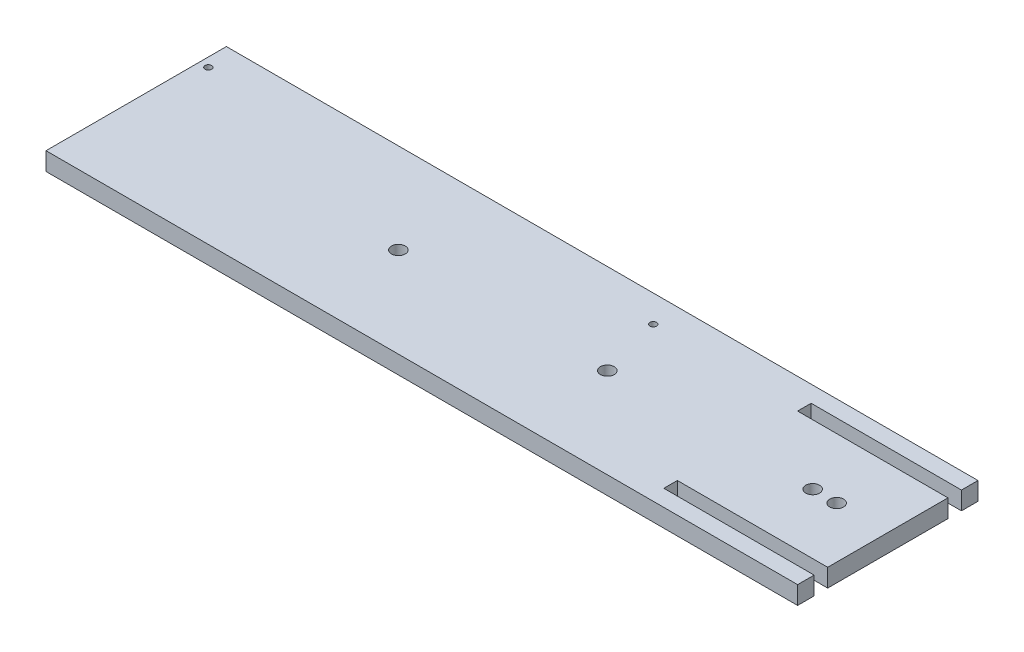
ISO-10303-21;
HEADER;
FILE_DESCRIPTION(('STEP AP214'),'2;1');
FILE_NAME('part.step','',(''),(''),'','','');
FILE_SCHEMA(('AUTOMOTIVE_DESIGN { 1 0 10303 214 1 1 1 1 }'));
ENDSEC;
DATA;
#1=APPLICATION_CONTEXT('core data for automotive mechanical design processes');
#2=APPLICATION_PROTOCOL_DEFINITION('international standard','automotive_design',2000,#1);
#3=PRODUCT_CONTEXT('',#1,'mechanical');
#4=PRODUCT('Part','Part','',(#3));
#5=PRODUCT_RELATED_PRODUCT_CATEGORY('part','',(#4));
#6=PRODUCT_DEFINITION_FORMATION('','',#4);
#7=PRODUCT_DEFINITION_CONTEXT('part definition',#1,'design');
#8=PRODUCT_DEFINITION('design','',#6,#7);
#9=PRODUCT_DEFINITION_SHAPE('','',#8);
#10=(LENGTH_UNIT() NAMED_UNIT(*) SI_UNIT(.MILLI.,.METRE.));
#11=(NAMED_UNIT(*) PLANE_ANGLE_UNIT() SI_UNIT($,.RADIAN.));
#12=(NAMED_UNIT(*) SI_UNIT($,.STERADIAN.) SOLID_ANGLE_UNIT());
#13=UNCERTAINTY_MEASURE_WITH_UNIT(LENGTH_MEASURE(1.E-05),#10,'distance_accuracy_value','');
#14=(GEOMETRIC_REPRESENTATION_CONTEXT(3) GLOBAL_UNCERTAINTY_ASSIGNED_CONTEXT((#13)) GLOBAL_UNIT_ASSIGNED_CONTEXT((#10,
#11,#12)) REPRESENTATION_CONTEXT('',''));
#15=CARTESIAN_POINT('',(0.,0.,0.));
#16=DIRECTION('',(0.,0.,1.));
#17=DIRECTION('',(1.,0.,0.));
#18=AXIS2_PLACEMENT_3D('',#15,#16,#17);
#19=CARTESIAN_POINT('',(125.,6.,-30.));
#20=DIRECTION('',(-1.,0.,0.));
#21=DIRECTION('',(0.,0.,1.));
#22=AXIS2_PLACEMENT_3D('',#19,#20,#21);
#23=PLANE('',#22);
#24=DIRECTION('',(0.,0.,-1.));
#25=VECTOR('',#24,1.);
#26=CARTESIAN_POINT('',(125.,0.,-30.));
#27=LINE('',#26,#25);
#28=CARTESIAN_POINT('',(125.,0.,20.));
#29=VERTEX_POINT('',#28);
#30=CARTESIAN_POINT('',(125.,0.,-20.));
#31=VERTEX_POINT('',#30);
#32=EDGE_CURVE('E223',#29,#31,#27,.T.);
#33=ORIENTED_EDGE('',*,*,#32,.T.);
#34=DIRECTION('',(0.,1.,0.));
#35=VECTOR('',#34,1.);
#36=CARTESIAN_POINT('',(125.,0.,-20.));
#37=LINE('',#36,#35);
#38=CARTESIAN_POINT('',(125.,6.,-20.));
#39=VERTEX_POINT('',#38);
#40=EDGE_CURVE('E154',#31,#39,#37,.T.);
#41=ORIENTED_EDGE('',*,*,#40,.T.);
#42=DIRECTION('',(0.,0.,-1.));
#43=VECTOR('',#42,1.);
#44=CARTESIAN_POINT('',(125.,6.,-30.));
#45=LINE('',#44,#43);
#46=CARTESIAN_POINT('',(125.,6.,20.));
#47=VERTEX_POINT('',#46);
#48=EDGE_CURVE('E211',#47,#39,#45,.T.);
#49=ORIENTED_EDGE('',*,*,#48,.F.);
#50=DIRECTION('',(0.,1.,0.));
#51=VECTOR('',#50,1.);
#52=CARTESIAN_POINT('',(125.,0.,20.));
#53=LINE('',#52,#51);
#54=EDGE_CURVE('E168',#29,#47,#53,.T.);
#55=ORIENTED_EDGE('',*,*,#54,.F.);
#56=EDGE_LOOP('',(#33,#41,#49,#55));
#57=FACE_BOUND('',#56,.T.);
#58=ADVANCED_FACE('F32',(#57),#23,.F.);
#59=CARTESIAN_POINT('',(125.,0.,30.));
#60=VERTEX_POINT('',#59);
#61=CARTESIAN_POINT('',(125.,0.,24.5));
#62=VERTEX_POINT('',#61);
#63=EDGE_CURVE('E219',#60,#62,#27,.T.);
#64=ORIENTED_EDGE('',*,*,#63,.T.);
#65=DIRECTION('',(0.,1.,0.));
#66=VECTOR('',#65,1.);
#67=CARTESIAN_POINT('',(125.,0.,24.5));
#68=LINE('',#67,#66);
#69=CARTESIAN_POINT('',(125.,6.,24.5));
#70=VERTEX_POINT('',#69);
#71=EDGE_CURVE('E175',#62,#70,#68,.T.);
#72=ORIENTED_EDGE('',*,*,#71,.T.);
#73=CARTESIAN_POINT('',(125.,6.,30.));
#74=VERTEX_POINT('',#73);
#75=EDGE_CURVE('E207',#74,#70,#45,.T.);
#76=ORIENTED_EDGE('',*,*,#75,.F.);
#77=DIRECTION('',(0.,-1.,0.));
#78=VECTOR('',#77,1.);
#79=CARTESIAN_POINT('',(125.,6.,30.));
#80=LINE('',#79,#78);
#81=EDGE_CURVE('E218',#74,#60,#80,.T.);
#82=ORIENTED_EDGE('',*,*,#81,.T.);
#83=EDGE_LOOP('',(#64,#72,#76,#82));
#84=FACE_BOUND('',#83,.T.);
#85=ADVANCED_FACE('F250',(#84),#23,.F.);
#86=CARTESIAN_POINT('',(0.,6.,0.));
#87=DIRECTION('',(0.,1.,0.));
#88=DIRECTION('',(0.,0.,1.));
#89=AXIS2_PLACEMENT_3D('',#86,#87,#88);
#90=PLANE('',#89);
#91=CARTESIAN_POINT('',(26.,6.,-21.));
#92=DIRECTION('',(0.,1.,0.));
#93=DIRECTION('',(0.,0.,1.));
#94=AXIS2_PLACEMENT_3D('',#91,#92,#93);
#95=CIRCLE('',#94,1.1);
#96=CARTESIAN_POINT('',(26.,6.,-19.9));
#97=VERTEX_POINT('',#96);
#98=EDGE_CURVE('E438',#97,#97,#95,.T.);
#99=ORIENTED_EDGE('',*,*,#98,.F.);
#100=EDGE_LOOP('',(#99));
#101=FACE_BOUND('',#100,.T.);
#102=CARTESIAN_POINT('',(-122.,6.,-21.));
#103=DIRECTION('',(0.,1.,0.));
#104=DIRECTION('',(0.,0.,1.));
#105=AXIS2_PLACEMENT_3D('',#102,#103,#104);
#106=CIRCLE('',#105,1.10000000000001);
#107=CARTESIAN_POINT('',(-122.,6.,-19.9));
#108=VERTEX_POINT('',#107);
#109=EDGE_CURVE('E148',#108,#108,#106,.T.);
#110=ORIENTED_EDGE('',*,*,#109,.F.);
#111=EDGE_LOOP('',(#110));
#112=FACE_BOUND('',#111,.T.);
#113=DIRECTION('',(1.,0.,0.));
#114=VECTOR('',#113,1.);
#115=CARTESIAN_POINT('',(125.,6.,-20.));
#116=LINE('',#115,#114);
#117=CARTESIAN_POINT('',(75.,6.,-20.));
#118=VERTEX_POINT('',#117);
#119=EDGE_CURVE('E143',#118,#39,#116,.T.);
#120=ORIENTED_EDGE('',*,*,#119,.F.);
#121=DIRECTION('',(0.,0.,1.));
#122=VECTOR('',#121,1.);
#123=CARTESIAN_POINT('',(75.,6.,-20.));
#124=LINE('',#123,#122);
#125=CARTESIAN_POINT('',(75.,6.,-24.5));
#126=VERTEX_POINT('',#125);
#127=EDGE_CURVE('E145',#126,#118,#124,.T.);
#128=ORIENTED_EDGE('',*,*,#127,.F.);
#129=DIRECTION('',(-1.,0.,0.));
#130=VECTOR('',#129,1.);
#131=CARTESIAN_POINT('',(125.,6.,-24.5));
#132=LINE('',#131,#130);
#133=CARTESIAN_POINT('',(125.,6.,-24.5));
#134=VERTEX_POINT('',#133);
#135=EDGE_CURVE('E123',#134,#126,#132,.T.);
#136=ORIENTED_EDGE('',*,*,#135,.F.);
#137=CARTESIAN_POINT('',(125.,6.,-30.));
#138=VERTEX_POINT('',#137);
#139=EDGE_CURVE('E212',#134,#138,#45,.T.);
#140=ORIENTED_EDGE('',*,*,#139,.T.);
#141=DIRECTION('',(-1.,0.,0.));
#142=VECTOR('',#141,1.);
#143=CARTESIAN_POINT('',(-125.,6.,-30.));
#144=LINE('',#143,#142);
#145=CARTESIAN_POINT('',(-125.,6.,-30.));
#146=VERTEX_POINT('',#145);
#147=EDGE_CURVE('E210',#138,#146,#144,.T.);
#148=ORIENTED_EDGE('',*,*,#147,.T.);
#149=DIRECTION('',(0.,0.,1.));
#150=VECTOR('',#149,1.);
#151=CARTESIAN_POINT('',(-125.,6.,-30.));
#152=LINE('',#151,#150);
#153=CARTESIAN_POINT('',(-125.,6.,30.));
#154=VERTEX_POINT('',#153);
#155=EDGE_CURVE('E214',#146,#154,#152,.T.);
#156=ORIENTED_EDGE('',*,*,#155,.T.);
#157=DIRECTION('',(1.,0.,0.));
#158=VECTOR('',#157,1.);
#159=CARTESIAN_POINT('',(-125.,6.,30.));
#160=LINE('',#159,#158);
#161=EDGE_CURVE('E216',#154,#74,#160,.T.);
#162=ORIENTED_EDGE('',*,*,#161,.T.);
#163=ORIENTED_EDGE('',*,*,#75,.T.);
#164=DIRECTION('',(1.,0.,0.));
#165=VECTOR('',#164,1.);
#166=CARTESIAN_POINT('',(125.,6.,24.5));
#167=LINE('',#166,#165);
#168=CARTESIAN_POINT('',(75.,6.,24.5));
#169=VERTEX_POINT('',#168);
#170=EDGE_CURVE('E162',#169,#70,#167,.T.);
#171=ORIENTED_EDGE('',*,*,#170,.F.);
#172=DIRECTION('',(0.,0.,1.));
#173=VECTOR('',#172,1.);
#174=CARTESIAN_POINT('',(75.,6.,20.));
#175=LINE('',#174,#173);
#176=CARTESIAN_POINT('',(75.,6.,20.));
#177=VERTEX_POINT('',#176);
#178=EDGE_CURVE('E171',#177,#169,#175,.T.);
#179=ORIENTED_EDGE('',*,*,#178,.F.);
#180=DIRECTION('',(-1.,0.,0.));
#181=VECTOR('',#180,1.);
#182=CARTESIAN_POINT('',(125.,6.,20.));
#183=LINE('',#182,#181);
#184=EDGE_CURVE('E157',#47,#177,#183,.T.);
#185=ORIENTED_EDGE('',*,*,#184,.F.);
#186=ORIENTED_EDGE('',*,*,#48,.T.);
#187=EDGE_LOOP('',(#120,#128,#136,#140,#148,#156,#162,#163,#171,#179,#185,#186));
#188=FACE_BOUND('',#187,.T.);
#189=CARTESIAN_POINT('',(31.7,6.,0.));
#190=DIRECTION('',(0.,1.,0.));
#191=DIRECTION('',(0.,0.,1.));
#192=AXIS2_PLACEMENT_3D('',#189,#190,#191);
#193=CIRCLE('',#192,2.3);
#194=CARTESIAN_POINT('',(31.7,6.,2.3));
#195=VERTEX_POINT('',#194);
#196=EDGE_CURVE('E190',#195,#195,#193,.T.);
#197=ORIENTED_EDGE('',*,*,#196,.F.);
#198=EDGE_LOOP('',(#197));
#199=FACE_BOUND('',#198,.T.);
#200=CARTESIAN_POINT('',(108.,6.,0.));
#201=DIRECTION('',(0.,1.,0.));
#202=DIRECTION('',(0.,0.,1.));
#203=AXIS2_PLACEMENT_3D('',#200,#201,#202);
#204=CIRCLE('',#203,2.29999999999999);
#205=CARTESIAN_POINT('',(108.,6.,2.29999999999999));
#206=VERTEX_POINT('',#205);
#207=EDGE_CURVE('E202',#206,#206,#204,.T.);
#208=ORIENTED_EDGE('',*,*,#207,.F.);
#209=EDGE_LOOP('',(#208));
#210=FACE_BOUND('',#209,.T.);
#211=CARTESIAN_POINT('',(100.,6.,0.));
#212=DIRECTION('',(0.,1.,0.));
#213=DIRECTION('',(0.,0.,1.));
#214=AXIS2_PLACEMENT_3D('',#211,#212,#213);
#215=CIRCLE('',#214,2.29999999999999);
#216=CARTESIAN_POINT('',(100.,6.,2.29999999999999));
#217=VERTEX_POINT('',#216);
#218=EDGE_CURVE('E196',#217,#217,#215,.T.);
#219=ORIENTED_EDGE('',*,*,#218,.F.);
#220=EDGE_LOOP('',(#219));
#221=FACE_BOUND('',#220,.T.);
#222=CARTESIAN_POINT('',(-37.8,6.,0.));
#223=DIRECTION('',(0.,1.,0.));
#224=DIRECTION('',(0.,0.,1.));
#225=AXIS2_PLACEMENT_3D('',#222,#223,#224);
#226=CIRCLE('',#225,2.3);
#227=CARTESIAN_POINT('',(-37.8,6.,2.3));
#228=VERTEX_POINT('',#227);
#229=EDGE_CURVE('E184',#228,#228,#226,.T.);
#230=ORIENTED_EDGE('',*,*,#229,.F.);
#231=EDGE_LOOP('',(#230));
#232=FACE_BOUND('',#231,.T.);
#233=ADVANCED_FACE('F254',(#101,#112,#188,#199,#210,#221,#232),#90,.T.);
#234=CARTESIAN_POINT('',(0.,0.,0.));
#235=DIRECTION('',(0.,1.,0.));
#236=DIRECTION('',(0.,0.,1.));
#237=AXIS2_PLACEMENT_3D('',#234,#235,#236);
#238=PLANE('',#237);
#239=CARTESIAN_POINT('',(26.,0.,-21.));
#240=DIRECTION('',(0.,-1.,0.));
#241=DIRECTION('',(0.,0.,-1.));
#242=AXIS2_PLACEMENT_3D('',#239,#240,#241);
#243=CIRCLE('',#242,1.1);
#244=CARTESIAN_POINT('',(26.,0.,-22.1));
#245=VERTEX_POINT('',#244);
#246=EDGE_CURVE('E440',#245,#245,#243,.T.);
#247=ORIENTED_EDGE('',*,*,#246,.F.);
#248=EDGE_LOOP('',(#247));
#249=FACE_BOUND('',#248,.T.);
#250=CARTESIAN_POINT('',(-122.,0.,-21.));
#251=DIRECTION('',(0.,-1.,0.));
#252=DIRECTION('',(0.,0.,-1.));
#253=AXIS2_PLACEMENT_3D('',#250,#251,#252);
#254=CIRCLE('',#253,1.10000000000001);
#255=CARTESIAN_POINT('',(-122.,0.,-22.1));
#256=VERTEX_POINT('',#255);
#257=EDGE_CURVE('E442',#256,#256,#254,.T.);
#258=ORIENTED_EDGE('',*,*,#257,.F.);
#259=EDGE_LOOP('',(#258));
#260=FACE_BOUND('',#259,.T.);
#261=CARTESIAN_POINT('',(31.7,0.,0.));
#262=DIRECTION('',(0.,1.,0.));
#263=DIRECTION('',(0.,0.,1.));
#264=AXIS2_PLACEMENT_3D('',#261,#262,#263);
#265=CIRCLE('',#264,2.3);
#266=CARTESIAN_POINT('',(31.7,0.,2.3));
#267=VERTEX_POINT('',#266);
#268=EDGE_CURVE('E187',#267,#267,#265,.T.);
#269=ORIENTED_EDGE('',*,*,#268,.T.);
#270=EDGE_LOOP('',(#269));
#271=FACE_BOUND('',#270,.T.);
#272=CARTESIAN_POINT('',(108.,0.,0.));
#273=DIRECTION('',(0.,1.,0.));
#274=DIRECTION('',(0.,0.,1.));
#275=AXIS2_PLACEMENT_3D('',#272,#273,#274);
#276=CIRCLE('',#275,2.29999999999999);
#277=CARTESIAN_POINT('',(108.,0.,2.29999999999999));
#278=VERTEX_POINT('',#277);
#279=EDGE_CURVE('E199',#278,#278,#276,.T.);
#280=ORIENTED_EDGE('',*,*,#279,.T.);
#281=EDGE_LOOP('',(#280));
#282=FACE_BOUND('',#281,.T.);
#283=DIRECTION('',(0.,0.,1.));
#284=VECTOR('',#283,1.);
#285=CARTESIAN_POINT('',(75.,0.,-20.));
#286=LINE('',#285,#284);
#287=CARTESIAN_POINT('',(75.,0.,-24.5));
#288=VERTEX_POINT('',#287);
#289=CARTESIAN_POINT('',(75.,0.,-20.));
#290=VERTEX_POINT('',#289);
#291=EDGE_CURVE('E131',#288,#290,#286,.T.);
#292=ORIENTED_EDGE('',*,*,#291,.T.);
#293=DIRECTION('',(1.,0.,0.));
#294=VECTOR('',#293,1.);
#295=CARTESIAN_POINT('',(125.,0.,-20.));
#296=LINE('',#295,#294);
#297=EDGE_CURVE('E136',#290,#31,#296,.T.);
#298=ORIENTED_EDGE('',*,*,#297,.T.);
#299=ORIENTED_EDGE('',*,*,#32,.F.);
#300=DIRECTION('',(-1.,0.,0.));
#301=VECTOR('',#300,1.);
#302=CARTESIAN_POINT('',(125.,0.,20.));
#303=LINE('',#302,#301);
#304=CARTESIAN_POINT('',(75.,0.,20.));
#305=VERTEX_POINT('',#304);
#306=EDGE_CURVE('E55',#29,#305,#303,.T.);
#307=ORIENTED_EDGE('',*,*,#306,.T.);
#308=DIRECTION('',(0.,0.,1.));
#309=VECTOR('',#308,1.);
#310=CARTESIAN_POINT('',(75.,0.,20.));
#311=LINE('',#310,#309);
#312=CARTESIAN_POINT('',(75.,0.,24.5));
#313=VERTEX_POINT('',#312);
#314=EDGE_CURVE('E161',#305,#313,#311,.T.);
#315=ORIENTED_EDGE('',*,*,#314,.T.);
#316=DIRECTION('',(1.,0.,0.));
#317=VECTOR('',#316,1.);
#318=CARTESIAN_POINT('',(125.,0.,24.5));
#319=LINE('',#318,#317);
#320=EDGE_CURVE('E165',#313,#62,#319,.T.);
#321=ORIENTED_EDGE('',*,*,#320,.T.);
#322=ORIENTED_EDGE('',*,*,#63,.F.);
#323=DIRECTION('',(1.,0.,0.));
#324=VECTOR('',#323,1.);
#325=CARTESIAN_POINT('',(-125.,0.,30.));
#326=LINE('',#325,#324);
#327=CARTESIAN_POINT('',(-125.,0.,30.));
#328=VERTEX_POINT('',#327);
#329=EDGE_CURVE('E227',#328,#60,#326,.T.);
#330=ORIENTED_EDGE('',*,*,#329,.F.);
#331=DIRECTION('',(0.,0.,1.));
#332=VECTOR('',#331,1.);
#333=CARTESIAN_POINT('',(-125.,0.,-30.));
#334=LINE('',#333,#332);
#335=CARTESIAN_POINT('',(-125.,0.,-30.));
#336=VERTEX_POINT('',#335);
#337=EDGE_CURVE('E225',#336,#328,#334,.T.);
#338=ORIENTED_EDGE('',*,*,#337,.F.);
#339=DIRECTION('',(-1.,0.,0.));
#340=VECTOR('',#339,1.);
#341=CARTESIAN_POINT('',(-125.,0.,-30.));
#342=LINE('',#341,#340);
#343=CARTESIAN_POINT('',(125.,0.,-30.));
#344=VERTEX_POINT('',#343);
#345=EDGE_CURVE('E222',#344,#336,#342,.T.);
#346=ORIENTED_EDGE('',*,*,#345,.F.);
#347=CARTESIAN_POINT('',(125.,0.,-24.5));
#348=VERTEX_POINT('',#347);
#349=EDGE_CURVE('E142',#348,#344,#27,.T.);
#350=ORIENTED_EDGE('',*,*,#349,.F.);
#351=DIRECTION('',(-1.,0.,0.));
#352=VECTOR('',#351,1.);
#353=CARTESIAN_POINT('',(125.,0.,-24.5));
#354=LINE('',#353,#352);
#355=EDGE_CURVE('E47',#348,#288,#354,.T.);
#356=ORIENTED_EDGE('',*,*,#355,.T.);
#357=EDGE_LOOP('',(#292,#298,#299,#307,#315,#321,#322,#330,#338,#346,#350,#356));
#358=FACE_BOUND('',#357,.T.);
#359=CARTESIAN_POINT('',(100.,0.,0.));
#360=DIRECTION('',(0.,1.,0.));
#361=DIRECTION('',(0.,0.,1.));
#362=AXIS2_PLACEMENT_3D('',#359,#360,#361);
#363=CIRCLE('',#362,2.29999999999999);
#364=CARTESIAN_POINT('',(100.,0.,2.29999999999999));
#365=VERTEX_POINT('',#364);
#366=EDGE_CURVE('E193',#365,#365,#363,.T.);
#367=ORIENTED_EDGE('',*,*,#366,.T.);
#368=EDGE_LOOP('',(#367));
#369=FACE_BOUND('',#368,.T.);
#370=CARTESIAN_POINT('',(-37.8,0.,0.));
#371=DIRECTION('',(0.,1.,0.));
#372=DIRECTION('',(0.,0.,1.));
#373=AXIS2_PLACEMENT_3D('',#370,#371,#372);
#374=CIRCLE('',#373,2.3);
#375=CARTESIAN_POINT('',(-37.8,0.,2.3));
#376=VERTEX_POINT('',#375);
#377=EDGE_CURVE('E178',#376,#376,#374,.T.);
#378=ORIENTED_EDGE('',*,*,#377,.T.);
#379=EDGE_LOOP('',(#378));
#380=FACE_BOUND('',#379,.T.);
#381=ADVANCED_FACE('F139',(#249,#260,#271,#282,#358,#369,#380),#238,.F.);
#382=ORIENTED_EDGE('',*,*,#139,.F.);
#383=DIRECTION('',(0.,1.,0.));
#384=VECTOR('',#383,1.);
#385=CARTESIAN_POINT('',(125.,0.,-24.5));
#386=LINE('',#385,#384);
#387=EDGE_CURVE('E128',#348,#134,#386,.T.);
#388=ORIENTED_EDGE('',*,*,#387,.F.);
#389=ORIENTED_EDGE('',*,*,#349,.T.);
#390=DIRECTION('',(0.,-1.,0.));
#391=VECTOR('',#390,1.);
#392=CARTESIAN_POINT('',(125.,6.,-30.));
#393=LINE('',#392,#391);
#394=EDGE_CURVE('E11',#138,#344,#393,.T.);
#395=ORIENTED_EDGE('',*,*,#394,.F.);
#396=EDGE_LOOP('',(#382,#388,#389,#395));
#397=FACE_BOUND('',#396,.T.);
#398=ADVANCED_FACE('F34',(#397),#23,.F.);
#399=CARTESIAN_POINT('',(-125.,6.,-30.));
#400=DIRECTION('',(0.,0.,1.));
#401=DIRECTION('',(1.,0.,0.));
#402=AXIS2_PLACEMENT_3D('',#399,#400,#401);
#403=PLANE('',#402);
#404=ORIENTED_EDGE('',*,*,#345,.T.);
#405=DIRECTION('',(0.,-1.,0.));
#406=VECTOR('',#405,1.);
#407=CARTESIAN_POINT('',(-125.,6.,-30.));
#408=LINE('',#407,#406);
#409=EDGE_CURVE('E40',#146,#336,#408,.T.);
#410=ORIENTED_EDGE('',*,*,#409,.F.);
#411=ORIENTED_EDGE('',*,*,#147,.F.);
#412=ORIENTED_EDGE('',*,*,#394,.T.);
#413=EDGE_LOOP('',(#404,#410,#411,#412));
#414=FACE_BOUND('',#413,.T.);
#415=ADVANCED_FACE('F259',(#414),#403,.F.);
#416=CARTESIAN_POINT('',(-125.,6.,-30.));
#417=DIRECTION('',(1.,0.,0.));
#418=DIRECTION('',(0.,0.,-1.));
#419=AXIS2_PLACEMENT_3D('',#416,#417,#418);
#420=PLANE('',#419);
#421=ORIENTED_EDGE('',*,*,#337,.T.);
#422=DIRECTION('',(0.,-1.,0.));
#423=VECTOR('',#422,1.);
#424=CARTESIAN_POINT('',(-125.,6.,30.));
#425=LINE('',#424,#423);
#426=EDGE_CURVE('E231',#154,#328,#425,.T.);
#427=ORIENTED_EDGE('',*,*,#426,.F.);
#428=ORIENTED_EDGE('',*,*,#155,.F.);
#429=ORIENTED_EDGE('',*,*,#409,.T.);
#430=EDGE_LOOP('',(#421,#427,#428,#429));
#431=FACE_BOUND('',#430,.T.);
#432=ADVANCED_FACE('F238',(#431),#420,.F.);
#433=CARTESIAN_POINT('',(-125.,6.,30.));
#434=DIRECTION('',(0.,0.,-1.));
#435=DIRECTION('',(-1.,0.,0.));
#436=AXIS2_PLACEMENT_3D('',#433,#434,#435);
#437=PLANE('',#436);
#438=ORIENTED_EDGE('',*,*,#329,.T.);
#439=ORIENTED_EDGE('',*,*,#81,.F.);
#440=ORIENTED_EDGE('',*,*,#161,.F.);
#441=ORIENTED_EDGE('',*,*,#426,.T.);
#442=EDGE_LOOP('',(#438,#439,#440,#441));
#443=FACE_BOUND('',#442,.T.);
#444=ADVANCED_FACE('F246',(#443),#437,.F.);
#445=CARTESIAN_POINT('',(108.,6.,0.));
#446=DIRECTION('',(0.,-1.,0.));
#447=DIRECTION('',(0.,0.,-1.));
#448=AXIS2_PLACEMENT_3D('',#445,#446,#447);
#449=CYLINDRICAL_SURFACE('',#448,2.29999999999999);
#450=ORIENTED_EDGE('',*,*,#207,.T.);
#451=EDGE_LOOP('',(#450));
#452=FACE_BOUND('',#451,.T.);
#453=ORIENTED_EDGE('',*,*,#279,.F.);
#454=EDGE_LOOP('',(#453));
#455=FACE_BOUND('',#454,.T.);
#456=ADVANCED_FACE('F310',(#452,#455),#449,.F.);
#457=CARTESIAN_POINT('',(100.,6.,0.));
#458=DIRECTION('',(0.,-1.,0.));
#459=DIRECTION('',(0.,0.,-1.));
#460=AXIS2_PLACEMENT_3D('',#457,#458,#459);
#461=CYLINDRICAL_SURFACE('',#460,2.29999999999999);
#462=ORIENTED_EDGE('',*,*,#218,.T.);
#463=EDGE_LOOP('',(#462));
#464=FACE_BOUND('',#463,.T.);
#465=ORIENTED_EDGE('',*,*,#366,.F.);
#466=EDGE_LOOP('',(#465));
#467=FACE_BOUND('',#466,.T.);
#468=ADVANCED_FACE('F326',(#464,#467),#461,.F.);
#469=CARTESIAN_POINT('',(31.7,6.,0.));
#470=DIRECTION('',(0.,-1.,0.));
#471=DIRECTION('',(0.,0.,-1.));
#472=AXIS2_PLACEMENT_3D('',#469,#470,#471);
#473=CYLINDRICAL_SURFACE('',#472,2.3);
#474=ORIENTED_EDGE('',*,*,#196,.T.);
#475=EDGE_LOOP('',(#474));
#476=FACE_BOUND('',#475,.T.);
#477=ORIENTED_EDGE('',*,*,#268,.F.);
#478=EDGE_LOOP('',(#477));
#479=FACE_BOUND('',#478,.T.);
#480=ADVANCED_FACE('F284',(#476,#479),#473,.F.);
#481=CARTESIAN_POINT('',(-37.8,6.,0.));
#482=DIRECTION('',(0.,-1.,0.));
#483=DIRECTION('',(0.,0.,-1.));
#484=AXIS2_PLACEMENT_3D('',#481,#482,#483);
#485=CYLINDRICAL_SURFACE('',#484,2.3);
#486=ORIENTED_EDGE('',*,*,#229,.T.);
#487=EDGE_LOOP('',(#486));
#488=FACE_BOUND('',#487,.T.);
#489=ORIENTED_EDGE('',*,*,#377,.F.);
#490=EDGE_LOOP('',(#489));
#491=FACE_BOUND('',#490,.T.);
#492=ADVANCED_FACE('F277',(#488,#491),#485,.F.);
#493=CARTESIAN_POINT('',(125.,0.,24.5));
#494=DIRECTION('',(0.,0.,1.));
#495=DIRECTION('',(1.,0.,0.));
#496=AXIS2_PLACEMENT_3D('',#493,#494,#495);
#497=PLANE('',#496);
#498=ORIENTED_EDGE('',*,*,#170,.T.);
#499=ORIENTED_EDGE('',*,*,#71,.F.);
#500=ORIENTED_EDGE('',*,*,#320,.F.);
#501=DIRECTION('',(0.,1.,0.));
#502=VECTOR('',#501,1.);
#503=CARTESIAN_POINT('',(75.,0.,24.5));
#504=LINE('',#503,#502);
#505=EDGE_CURVE('E179',#313,#169,#504,.T.);
#506=ORIENTED_EDGE('',*,*,#505,.T.);
#507=EDGE_LOOP('',(#498,#499,#500,#506));
#508=FACE_BOUND('',#507,.T.);
#509=ADVANCED_FACE('F275',(#508),#497,.F.);
#510=CARTESIAN_POINT('',(75.,0.,20.));
#511=DIRECTION('',(-1.,0.,0.));
#512=DIRECTION('',(0.,0.,1.));
#513=AXIS2_PLACEMENT_3D('',#510,#511,#512);
#514=PLANE('',#513);
#515=ORIENTED_EDGE('',*,*,#178,.T.);
#516=ORIENTED_EDGE('',*,*,#505,.F.);
#517=ORIENTED_EDGE('',*,*,#314,.F.);
#518=DIRECTION('',(0.,1.,0.));
#519=VECTOR('',#518,1.);
#520=CARTESIAN_POINT('',(75.,0.,20.));
#521=LINE('',#520,#519);
#522=EDGE_CURVE('E181',#305,#177,#521,.T.);
#523=ORIENTED_EDGE('',*,*,#522,.T.);
#524=EDGE_LOOP('',(#515,#516,#517,#523));
#525=FACE_BOUND('',#524,.T.);
#526=ADVANCED_FACE('F272',(#525),#514,.F.);
#527=CARTESIAN_POINT('',(125.,0.,20.));
#528=DIRECTION('',(0.,0.,-1.));
#529=DIRECTION('',(-1.,0.,0.));
#530=AXIS2_PLACEMENT_3D('',#527,#528,#529);
#531=PLANE('',#530);
#532=ORIENTED_EDGE('',*,*,#184,.T.);
#533=ORIENTED_EDGE('',*,*,#522,.F.);
#534=ORIENTED_EDGE('',*,*,#306,.F.);
#535=ORIENTED_EDGE('',*,*,#54,.T.);
#536=EDGE_LOOP('',(#532,#533,#534,#535));
#537=FACE_BOUND('',#536,.T.);
#538=ADVANCED_FACE('F269',(#537),#531,.F.);
#539=CARTESIAN_POINT('',(125.,0.,-20.));
#540=DIRECTION('',(0.,0.,1.));
#541=DIRECTION('',(1.,0.,0.));
#542=AXIS2_PLACEMENT_3D('',#539,#540,#541);
#543=PLANE('',#542);
#544=ORIENTED_EDGE('',*,*,#119,.T.);
#545=ORIENTED_EDGE('',*,*,#40,.F.);
#546=ORIENTED_EDGE('',*,*,#297,.F.);
#547=DIRECTION('',(0.,1.,0.));
#548=VECTOR('',#547,1.);
#549=CARTESIAN_POINT('',(75.,0.,-20.));
#550=LINE('',#549,#548);
#551=EDGE_CURVE('E127',#290,#118,#550,.T.);
#552=ORIENTED_EDGE('',*,*,#551,.T.);
#553=EDGE_LOOP('',(#544,#545,#546,#552));
#554=FACE_BOUND('',#553,.T.);
#555=ADVANCED_FACE('F267',(#554),#543,.F.);
#556=CARTESIAN_POINT('',(75.,0.,-20.));
#557=DIRECTION('',(-1.,0.,0.));
#558=DIRECTION('',(0.,0.,1.));
#559=AXIS2_PLACEMENT_3D('',#556,#557,#558);
#560=PLANE('',#559);
#561=ORIENTED_EDGE('',*,*,#127,.T.);
#562=ORIENTED_EDGE('',*,*,#551,.F.);
#563=ORIENTED_EDGE('',*,*,#291,.F.);
#564=DIRECTION('',(0.,1.,0.));
#565=VECTOR('',#564,1.);
#566=CARTESIAN_POINT('',(75.,0.,-24.5));
#567=LINE('',#566,#565);
#568=EDGE_CURVE('E119',#288,#126,#567,.T.);
#569=ORIENTED_EDGE('',*,*,#568,.T.);
#570=EDGE_LOOP('',(#561,#562,#563,#569));
#571=FACE_BOUND('',#570,.T.);
#572=ADVANCED_FACE('F132',(#571),#560,.F.);
#573=CARTESIAN_POINT('',(125.,0.,-24.5));
#574=DIRECTION('',(0.,0.,-1.));
#575=DIRECTION('',(-1.,0.,0.));
#576=AXIS2_PLACEMENT_3D('',#573,#574,#575);
#577=PLANE('',#576);
#578=ORIENTED_EDGE('',*,*,#135,.T.);
#579=ORIENTED_EDGE('',*,*,#568,.F.);
#580=ORIENTED_EDGE('',*,*,#355,.F.);
#581=ORIENTED_EDGE('',*,*,#387,.T.);
#582=EDGE_LOOP('',(#578,#579,#580,#581));
#583=FACE_BOUND('',#582,.T.);
#584=ADVANCED_FACE('F121',(#583),#577,.F.);
#585=CARTESIAN_POINT('',(-122.,10.,-21.));
#586=DIRECTION('',(0.,-1.,0.));
#587=DIRECTION('',(0.,0.,-1.));
#588=AXIS2_PLACEMENT_3D('',#585,#586,#587);
#589=CYLINDRICAL_SURFACE('',#588,1.10000000000001);
#590=ORIENTED_EDGE('',*,*,#109,.T.);
#591=EDGE_LOOP('',(#590));
#592=FACE_BOUND('',#591,.T.);
#593=ORIENTED_EDGE('',*,*,#257,.T.);
#594=EDGE_LOOP('',(#593));
#595=FACE_BOUND('',#594,.T.);
#596=ADVANCED_FACE('F404',(#592,#595),#589,.F.);
#597=CARTESIAN_POINT('',(26.,10.,-21.));
#598=DIRECTION('',(0.,-1.,0.));
#599=DIRECTION('',(0.,0.,-1.));
#600=AXIS2_PLACEMENT_3D('',#597,#598,#599);
#601=CYLINDRICAL_SURFACE('',#600,1.1);
#602=ORIENTED_EDGE('',*,*,#98,.T.);
#603=EDGE_LOOP('',(#602));
#604=FACE_BOUND('',#603,.T.);
#605=ORIENTED_EDGE('',*,*,#246,.T.);
#606=EDGE_LOOP('',(#605));
#607=FACE_BOUND('',#606,.T.);
#608=ADVANCED_FACE('F421',(#604,#607),#601,.F.);
#609=CLOSED_SHELL('',(#58,#85,#233,#381,#398,#415,#432,#444,#456,#468,#480,#492,#509,#526,#538,
#555,#572,#584,#596,#608));
#610=MANIFOLD_SOLID_BREP('B2',#609);
#611=ADVANCED_BREP_SHAPE_REPRESENTATION('',(#18,#610),#14);
#612=SHAPE_DEFINITION_REPRESENTATION(#9,#611);
ENDSEC;
END-ISO-10303-21;
